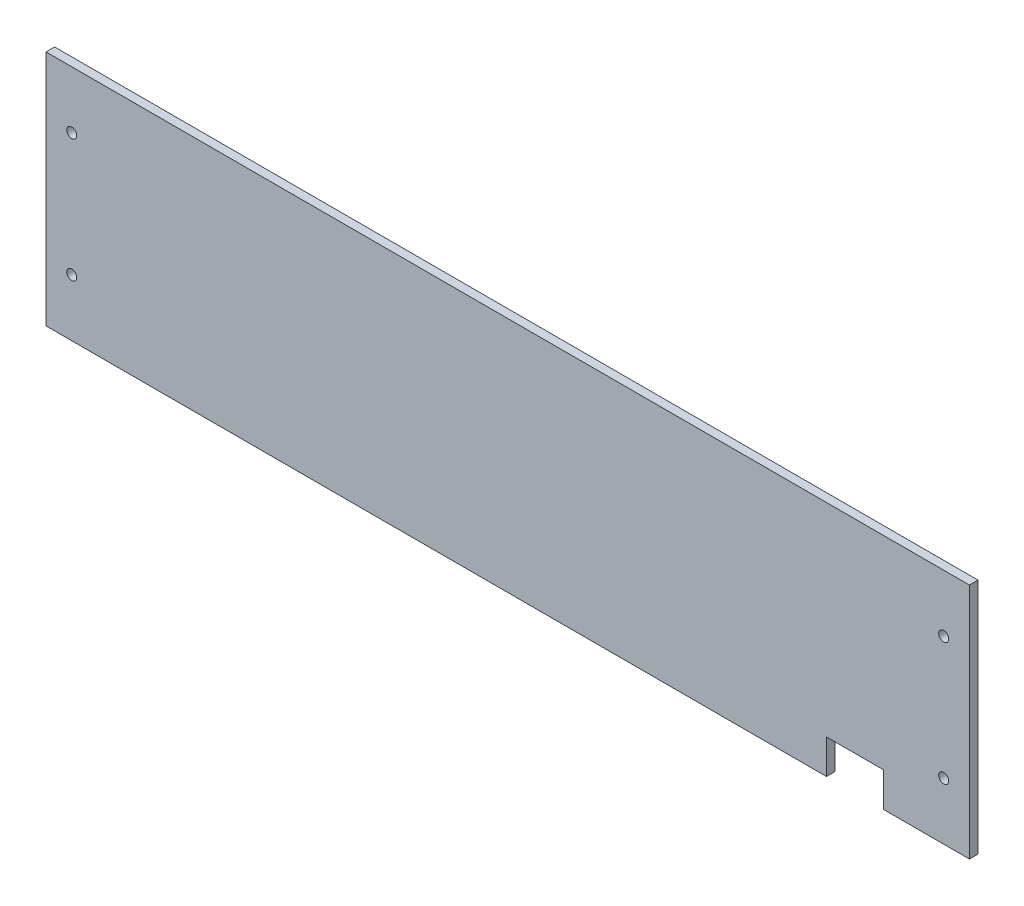
ISO-10303-21;
HEADER;
FILE_DESCRIPTION(('STEP AP214'),'2;1');
FILE_NAME('part.step','',(''),(''),'','','');
FILE_SCHEMA(('AUTOMOTIVE_DESIGN { 1 0 10303 214 1 1 1 1 }'));
ENDSEC;
DATA;
#1=APPLICATION_CONTEXT('core data for automotive mechanical design processes');
#2=APPLICATION_PROTOCOL_DEFINITION('international standard','automotive_design',2000,#1);
#3=PRODUCT_CONTEXT('',#1,'mechanical');
#4=PRODUCT('Part','Part','',(#3));
#5=PRODUCT_RELATED_PRODUCT_CATEGORY('part','',(#4));
#6=PRODUCT_DEFINITION_FORMATION('','',#4);
#7=PRODUCT_DEFINITION_CONTEXT('part definition',#1,'design');
#8=PRODUCT_DEFINITION('design','',#6,#7);
#9=PRODUCT_DEFINITION_SHAPE('','',#8);
#10=(LENGTH_UNIT() NAMED_UNIT(*) SI_UNIT(.MILLI.,.METRE.));
#11=(NAMED_UNIT(*) PLANE_ANGLE_UNIT() SI_UNIT($,.RADIAN.));
#12=(NAMED_UNIT(*) SI_UNIT($,.STERADIAN.) SOLID_ANGLE_UNIT());
#13=UNCERTAINTY_MEASURE_WITH_UNIT(LENGTH_MEASURE(1.E-05),#10,'distance_accuracy_value','');
#14=(GEOMETRIC_REPRESENTATION_CONTEXT(3) GLOBAL_UNCERTAINTY_ASSIGNED_CONTEXT((#13)) GLOBAL_UNIT_ASSIGNED_CONTEXT((#10,
#11,#12)) REPRESENTATION_CONTEXT('',''));
#15=CARTESIAN_POINT('',(0.,0.,0.));
#16=DIRECTION('',(0.,0.,1.));
#17=DIRECTION('',(1.,0.,0.));
#18=AXIS2_PLACEMENT_3D('',#15,#16,#17);
#19=CARTESIAN_POINT('',(-161.5,-41.5,3.));
#20=DIRECTION('',(0.,1.,0.));
#21=DIRECTION('',(0.,0.,1.));
#22=AXIS2_PLACEMENT_3D('',#19,#20,#21);
#23=PLANE('',#22);
#24=DIRECTION('',(1.,0.,0.));
#25=VECTOR('',#24,1.);
#26=CARTESIAN_POINT('',(-161.5,-41.5,3.));
#27=LINE('',#26,#25);
#28=CARTESIAN_POINT('',(131.5,-41.5,3.));
#29=VERTEX_POINT('',#28);
#30=CARTESIAN_POINT('',(161.5,-41.5,3.));
#31=VERTEX_POINT('',#30);
#32=EDGE_CURVE('E63',#29,#31,#27,.T.);
#33=ORIENTED_EDGE('',*,*,#32,.F.);
#34=DIRECTION('',(0.,0.,-1.));
#35=VECTOR('',#34,1.);
#36=CARTESIAN_POINT('',(131.5,-41.5,10.));
#37=LINE('',#36,#35);
#38=CARTESIAN_POINT('',(131.5,-41.5,0.));
#39=VERTEX_POINT('',#38);
#40=EDGE_CURVE('E139',#29,#39,#37,.T.);
#41=ORIENTED_EDGE('',*,*,#40,.T.);
#42=DIRECTION('',(1.,0.,0.));
#43=VECTOR('',#42,1.);
#44=CARTESIAN_POINT('',(-161.5,-41.5,0.));
#45=LINE('',#44,#43);
#46=CARTESIAN_POINT('',(161.5,-41.5,0.));
#47=VERTEX_POINT('',#46);
#48=EDGE_CURVE('E85',#39,#47,#45,.T.);
#49=ORIENTED_EDGE('',*,*,#48,.T.);
#50=DIRECTION('',(0.,0.,-1.));
#51=VECTOR('',#50,1.);
#52=CARTESIAN_POINT('',(161.5,-41.5,3.));
#53=LINE('',#52,#51);
#54=EDGE_CURVE('E158',#31,#47,#53,.T.);
#55=ORIENTED_EDGE('',*,*,#54,.F.);
#56=EDGE_LOOP('',(#33,#41,#49,#55));
#57=FACE_BOUND('',#56,.T.);
#58=ADVANCED_FACE('F39',(#57),#23,.F.);
#59=CARTESIAN_POINT('',(161.5,41.5,3.));
#60=DIRECTION('',(-1.,0.,0.));
#61=DIRECTION('',(0.,0.,1.));
#62=AXIS2_PLACEMENT_3D('',#59,#60,#61);
#63=PLANE('',#62);
#64=DIRECTION('',(0.,1.,0.));
#65=VECTOR('',#64,1.);
#66=CARTESIAN_POINT('',(161.5,41.5,0.));
#67=LINE('',#66,#65);
#68=CARTESIAN_POINT('',(161.5,41.5,0.));
#69=VERTEX_POINT('',#68);
#70=EDGE_CURVE('E148',#47,#69,#67,.T.);
#71=ORIENTED_EDGE('',*,*,#70,.T.);
#72=DIRECTION('',(0.,0.,-1.));
#73=VECTOR('',#72,1.);
#74=CARTESIAN_POINT('',(161.5,41.5,3.));
#75=LINE('',#74,#73);
#76=CARTESIAN_POINT('',(161.5,41.5,3.));
#77=VERTEX_POINT('',#76);
#78=EDGE_CURVE('E11',#77,#69,#75,.T.);
#79=ORIENTED_EDGE('',*,*,#78,.F.);
#80=DIRECTION('',(0.,1.,0.));
#81=VECTOR('',#80,1.);
#82=CARTESIAN_POINT('',(161.5,41.5,3.));
#83=LINE('',#82,#81);
#84=EDGE_CURVE('E149',#31,#77,#83,.T.);
#85=ORIENTED_EDGE('',*,*,#84,.F.);
#86=ORIENTED_EDGE('',*,*,#54,.T.);
#87=EDGE_LOOP('',(#71,#79,#85,#86));
#88=FACE_BOUND('',#87,.T.);
#89=ADVANCED_FACE('F41',(#88),#63,.F.);
#90=CARTESIAN_POINT('',(-161.5,41.5,3.));
#91=DIRECTION('',(0.,-1.,0.));
#92=DIRECTION('',(0.,0.,-1.));
#93=AXIS2_PLACEMENT_3D('',#90,#91,#92);
#94=PLANE('',#93);
#95=DIRECTION('',(-1.,0.,0.));
#96=VECTOR('',#95,1.);
#97=CARTESIAN_POINT('',(-161.5,41.5,0.));
#98=LINE('',#97,#96);
#99=CARTESIAN_POINT('',(-161.5,41.5,0.));
#100=VERTEX_POINT('',#99);
#101=EDGE_CURVE('E161',#69,#100,#98,.T.);
#102=ORIENTED_EDGE('',*,*,#101,.T.);
#103=DIRECTION('',(0.,0.,-1.));
#104=VECTOR('',#103,1.);
#105=CARTESIAN_POINT('',(-161.5,41.5,3.));
#106=LINE('',#105,#104);
#107=CARTESIAN_POINT('',(-161.5,41.5,3.));
#108=VERTEX_POINT('',#107);
#109=EDGE_CURVE('E47',#108,#100,#106,.T.);
#110=ORIENTED_EDGE('',*,*,#109,.F.);
#111=DIRECTION('',(-1.,0.,0.));
#112=VECTOR('',#111,1.);
#113=CARTESIAN_POINT('',(-161.5,41.5,3.));
#114=LINE('',#113,#112);
#115=EDGE_CURVE('E92',#77,#108,#114,.T.);
#116=ORIENTED_EDGE('',*,*,#115,.F.);
#117=ORIENTED_EDGE('',*,*,#78,.T.);
#118=EDGE_LOOP('',(#102,#110,#116,#117));
#119=FACE_BOUND('',#118,.T.);
#120=ADVANCED_FACE('F183',(#119),#94,.F.);
#121=CARTESIAN_POINT('',(-161.5,41.5,3.));
#122=DIRECTION('',(1.,0.,0.));
#123=DIRECTION('',(0.,0.,-1.));
#124=AXIS2_PLACEMENT_3D('',#121,#122,#123);
#125=PLANE('',#124);
#126=DIRECTION('',(0.,-1.,0.));
#127=VECTOR('',#126,1.);
#128=CARTESIAN_POINT('',(-161.5,41.5,0.));
#129=LINE('',#128,#127);
#130=CARTESIAN_POINT('',(-161.5,-41.5,0.));
#131=VERTEX_POINT('',#130);
#132=EDGE_CURVE('E163',#100,#131,#129,.T.);
#133=ORIENTED_EDGE('',*,*,#132,.T.);
#134=DIRECTION('',(0.,0.,-1.));
#135=VECTOR('',#134,1.);
#136=CARTESIAN_POINT('',(-161.5,-41.5,3.));
#137=LINE('',#136,#135);
#138=CARTESIAN_POINT('',(-161.5,-41.5,3.));
#139=VERTEX_POINT('',#138);
#140=EDGE_CURVE('E167',#139,#131,#137,.T.);
#141=ORIENTED_EDGE('',*,*,#140,.F.);
#142=DIRECTION('',(0.,-1.,0.));
#143=VECTOR('',#142,1.);
#144=CARTESIAN_POINT('',(-161.5,41.5,3.));
#145=LINE('',#144,#143);
#146=EDGE_CURVE('E153',#108,#139,#145,.T.);
#147=ORIENTED_EDGE('',*,*,#146,.F.);
#148=ORIENTED_EDGE('',*,*,#109,.T.);
#149=EDGE_LOOP('',(#133,#141,#147,#148));
#150=FACE_BOUND('',#149,.T.);
#151=ADVANCED_FACE('F173',(#150),#125,.F.);
#152=CARTESIAN_POINT('',(111.5,-41.5,0.));
#153=VERTEX_POINT('',#152);
#154=EDGE_CURVE('E151',#131,#153,#45,.T.);
#155=ORIENTED_EDGE('',*,*,#154,.T.);
#156=DIRECTION('',(0.,0.,-1.));
#157=VECTOR('',#156,1.);
#158=CARTESIAN_POINT('',(111.5,-41.5,10.));
#159=LINE('',#158,#157);
#160=CARTESIAN_POINT('',(111.5,-41.5,3.));
#161=VERTEX_POINT('',#160);
#162=EDGE_CURVE('E54',#161,#153,#159,.T.);
#163=ORIENTED_EDGE('',*,*,#162,.F.);
#164=EDGE_CURVE('E155',#139,#161,#27,.T.);
#165=ORIENTED_EDGE('',*,*,#164,.F.);
#166=ORIENTED_EDGE('',*,*,#140,.T.);
#167=EDGE_LOOP('',(#155,#163,#165,#166));
#168=FACE_BOUND('',#167,.T.);
#169=ADVANCED_FACE('F177',(#168),#23,.F.);
#170=CARTESIAN_POINT('',(0.,0.,3.));
#171=DIRECTION('',(0.,0.,1.));
#172=DIRECTION('',(1.,0.,0.));
#173=AXIS2_PLACEMENT_3D('',#170,#171,#172);
#174=PLANE('',#173);
#175=CARTESIAN_POINT('',(152.5,-21.5,3.));
#176=DIRECTION('',(0.,0.,-1.));
#177=DIRECTION('',(-1.,0.,0.));
#178=AXIS2_PLACEMENT_3D('',#175,#176,#177);
#179=CIRCLE('',#178,1.75000000000001);
#180=CARTESIAN_POINT('',(150.75,-21.5,3.));
#181=VERTEX_POINT('',#180);
#182=EDGE_CURVE('E256',#181,#181,#179,.T.);
#183=ORIENTED_EDGE('',*,*,#182,.T.);
#184=EDGE_LOOP('',(#183));
#185=FACE_BOUND('',#184,.T.);
#186=CARTESIAN_POINT('',(-152.5,21.5,3.));
#187=DIRECTION('',(0.,0.,-1.));
#188=DIRECTION('',(-1.,0.,0.));
#189=AXIS2_PLACEMENT_3D('',#186,#187,#188);
#190=CIRCLE('',#189,1.75000000000001);
#191=CARTESIAN_POINT('',(-154.25,21.5,3.));
#192=VERTEX_POINT('',#191);
#193=EDGE_CURVE('E245',#192,#192,#190,.T.);
#194=ORIENTED_EDGE('',*,*,#193,.T.);
#195=EDGE_LOOP('',(#194));
#196=FACE_BOUND('',#195,.T.);
#197=CARTESIAN_POINT('',(152.5,21.5,3.));
#198=DIRECTION('',(0.,0.,-1.));
#199=DIRECTION('',(-1.,0.,0.));
#200=AXIS2_PLACEMENT_3D('',#197,#198,#199);
#201=CIRCLE('',#200,1.75000000000001);
#202=CARTESIAN_POINT('',(150.75,21.5,3.));
#203=VERTEX_POINT('',#202);
#204=EDGE_CURVE('E240',#203,#203,#201,.T.);
#205=ORIENTED_EDGE('',*,*,#204,.T.);
#206=EDGE_LOOP('',(#205));
#207=FACE_BOUND('',#206,.T.);
#208=CARTESIAN_POINT('',(-152.5,-21.5,3.));
#209=DIRECTION('',(0.,0.,-1.));
#210=DIRECTION('',(-1.,0.,0.));
#211=AXIS2_PLACEMENT_3D('',#208,#209,#210);
#212=CIRCLE('',#211,1.75000000000001);
#213=CARTESIAN_POINT('',(-154.25,-21.5,3.));
#214=VERTEX_POINT('',#213);
#215=EDGE_CURVE('E131',#214,#214,#212,.T.);
#216=ORIENTED_EDGE('',*,*,#215,.T.);
#217=EDGE_LOOP('',(#216));
#218=FACE_BOUND('',#217,.T.);
#219=DIRECTION('',(0.,1.,0.));
#220=VECTOR('',#219,1.);
#221=CARTESIAN_POINT('',(131.5,3.041548494546E-13,3.));
#222=LINE('',#221,#220);
#223=CARTESIAN_POINT('',(131.5,-29.5,3.));
#224=VERTEX_POINT('',#223);
#225=EDGE_CURVE('E146',#29,#224,#222,.T.);
#226=ORIENTED_EDGE('',*,*,#225,.F.);
#227=ORIENTED_EDGE('',*,*,#32,.T.);
#228=ORIENTED_EDGE('',*,*,#84,.T.);
#229=ORIENTED_EDGE('',*,*,#115,.T.);
#230=ORIENTED_EDGE('',*,*,#146,.T.);
#231=ORIENTED_EDGE('',*,*,#164,.T.);
#232=DIRECTION('',(0.,-1.,0.));
#233=VECTOR('',#232,1.);
#234=CARTESIAN_POINT('',(111.5,0.,3.));
#235=LINE('',#234,#233);
#236=CARTESIAN_POINT('',(111.5,-29.5,3.));
#237=VERTEX_POINT('',#236);
#238=EDGE_CURVE('E141',#237,#161,#235,.T.);
#239=ORIENTED_EDGE('',*,*,#238,.F.);
#240=DIRECTION('',(-1.,0.,0.));
#241=VECTOR('',#240,1.);
#242=CARTESIAN_POINT('',(0.,-29.5,3.));
#243=LINE('',#242,#241);
#244=EDGE_CURVE('E122',#224,#237,#243,.T.);
#245=ORIENTED_EDGE('',*,*,#244,.F.);
#246=EDGE_LOOP('',(#226,#227,#228,#229,#230,#231,#239,#245));
#247=FACE_BOUND('',#246,.T.);
#248=ADVANCED_FACE('F179',(#185,#196,#207,#218,#247),#174,.T.);
#249=CARTESIAN_POINT('',(0.,0.,0.));
#250=DIRECTION('',(0.,0.,1.));
#251=DIRECTION('',(1.,0.,0.));
#252=AXIS2_PLACEMENT_3D('',#249,#250,#251);
#253=PLANE('',#252);
#254=CARTESIAN_POINT('',(152.5,-21.5,0.));
#255=DIRECTION('',(0.,0.,-1.));
#256=DIRECTION('',(-1.,0.,0.));
#257=AXIS2_PLACEMENT_3D('',#254,#255,#256);
#258=CIRCLE('',#257,1.75000000000001);
#259=CARTESIAN_POINT('',(150.75,-21.5,0.));
#260=VERTEX_POINT('',#259);
#261=EDGE_CURVE('E252',#260,#260,#258,.T.);
#262=ORIENTED_EDGE('',*,*,#261,.F.);
#263=EDGE_LOOP('',(#262));
#264=FACE_BOUND('',#263,.T.);
#265=CARTESIAN_POINT('',(-152.5,21.5,0.));
#266=DIRECTION('',(0.,0.,-1.));
#267=DIRECTION('',(-1.,0.,0.));
#268=AXIS2_PLACEMENT_3D('',#265,#266,#267);
#269=CIRCLE('',#268,1.75000000000001);
#270=CARTESIAN_POINT('',(-154.25,21.5,0.));
#271=VERTEX_POINT('',#270);
#272=EDGE_CURVE('E248',#271,#271,#269,.T.);
#273=ORIENTED_EDGE('',*,*,#272,.F.);
#274=EDGE_LOOP('',(#273));
#275=FACE_BOUND('',#274,.T.);
#276=CARTESIAN_POINT('',(152.5,21.5,0.));
#277=DIRECTION('',(0.,0.,-1.));
#278=DIRECTION('',(-1.,0.,0.));
#279=AXIS2_PLACEMENT_3D('',#276,#277,#278);
#280=CIRCLE('',#279,1.75000000000001);
#281=CARTESIAN_POINT('',(150.75,21.5,0.));
#282=VERTEX_POINT('',#281);
#283=EDGE_CURVE('E243',#282,#282,#280,.T.);
#284=ORIENTED_EDGE('',*,*,#283,.F.);
#285=EDGE_LOOP('',(#284));
#286=FACE_BOUND('',#285,.T.);
#287=CARTESIAN_POINT('',(-152.5,-21.5,0.));
#288=DIRECTION('',(0.,0.,-1.));
#289=DIRECTION('',(-1.,0.,0.));
#290=AXIS2_PLACEMENT_3D('',#287,#288,#289);
#291=CIRCLE('',#290,1.75000000000001);
#292=CARTESIAN_POINT('',(-154.25,-21.5,0.));
#293=VERTEX_POINT('',#292);
#294=EDGE_CURVE('E255',#293,#293,#291,.T.);
#295=ORIENTED_EDGE('',*,*,#294,.F.);
#296=EDGE_LOOP('',(#295));
#297=FACE_BOUND('',#296,.T.);
#298=ORIENTED_EDGE('',*,*,#48,.F.);
#299=DIRECTION('',(0.,-1.,0.));
#300=VECTOR('',#299,1.);
#301=CARTESIAN_POINT('',(131.5,-41.5,0.));
#302=LINE('',#301,#300);
#303=CARTESIAN_POINT('',(131.5,-29.5,0.));
#304=VERTEX_POINT('',#303);
#305=EDGE_CURVE('E134',#304,#39,#302,.T.);
#306=ORIENTED_EDGE('',*,*,#305,.F.);
#307=DIRECTION('',(1.,0.,0.));
#308=VECTOR('',#307,1.);
#309=CARTESIAN_POINT('',(131.5,-29.5,0.));
#310=LINE('',#309,#308);
#311=CARTESIAN_POINT('',(111.5,-29.5,0.));
#312=VERTEX_POINT('',#311);
#313=EDGE_CURVE('E119',#312,#304,#310,.T.);
#314=ORIENTED_EDGE('',*,*,#313,.F.);
#315=DIRECTION('',(0.,1.,0.));
#316=VECTOR('',#315,1.);
#317=CARTESIAN_POINT('',(111.5,-29.5,0.));
#318=LINE('',#317,#316);
#319=EDGE_CURVE('E126',#153,#312,#318,.T.);
#320=ORIENTED_EDGE('',*,*,#319,.F.);
#321=ORIENTED_EDGE('',*,*,#154,.F.);
#322=ORIENTED_EDGE('',*,*,#132,.F.);
#323=ORIENTED_EDGE('',*,*,#101,.F.);
#324=ORIENTED_EDGE('',*,*,#70,.F.);
#325=EDGE_LOOP('',(#298,#306,#314,#320,#321,#322,#323,#324));
#326=FACE_BOUND('',#325,.T.);
#327=ADVANCED_FACE('F133',(#264,#275,#286,#297,#326),#253,.F.);
#328=CARTESIAN_POINT('',(131.5,-41.5,10.));
#329=DIRECTION('',(1.,0.,0.));
#330=DIRECTION('',(0.,1.,0.));
#331=AXIS2_PLACEMENT_3D('',#328,#329,#330);
#332=PLANE('',#331);
#333=ORIENTED_EDGE('',*,*,#225,.T.);
#334=DIRECTION('',(0.,0.,-1.));
#335=VECTOR('',#334,1.);
#336=CARTESIAN_POINT('',(131.5,-29.5,10.));
#337=LINE('',#336,#335);
#338=EDGE_CURVE('E124',#224,#304,#337,.T.);
#339=ORIENTED_EDGE('',*,*,#338,.T.);
#340=ORIENTED_EDGE('',*,*,#305,.T.);
#341=ORIENTED_EDGE('',*,*,#40,.F.);
#342=EDGE_LOOP('',(#333,#339,#340,#341));
#343=FACE_BOUND('',#342,.T.);
#344=ADVANCED_FACE('F208',(#343),#332,.F.);
#345=CARTESIAN_POINT('',(131.5,-29.5,10.));
#346=DIRECTION('',(0.,1.,0.));
#347=DIRECTION('',(0.,0.,1.));
#348=AXIS2_PLACEMENT_3D('',#345,#346,#347);
#349=PLANE('',#348);
#350=ORIENTED_EDGE('',*,*,#244,.T.);
#351=DIRECTION('',(0.,0.,-1.));
#352=VECTOR('',#351,1.);
#353=CARTESIAN_POINT('',(111.5,-29.5,10.));
#354=LINE('',#353,#352);
#355=EDGE_CURVE('E115',#237,#312,#354,.T.);
#356=ORIENTED_EDGE('',*,*,#355,.T.);
#357=ORIENTED_EDGE('',*,*,#313,.T.);
#358=ORIENTED_EDGE('',*,*,#338,.F.);
#359=EDGE_LOOP('',(#350,#356,#357,#358));
#360=FACE_BOUND('',#359,.T.);
#361=ADVANCED_FACE('F116',(#360),#349,.F.);
#362=CARTESIAN_POINT('',(111.5,-29.5,10.));
#363=DIRECTION('',(-1.,0.,0.));
#364=DIRECTION('',(0.,0.,1.));
#365=AXIS2_PLACEMENT_3D('',#362,#363,#364);
#366=PLANE('',#365);
#367=ORIENTED_EDGE('',*,*,#238,.T.);
#368=ORIENTED_EDGE('',*,*,#162,.T.);
#369=ORIENTED_EDGE('',*,*,#319,.T.);
#370=ORIENTED_EDGE('',*,*,#355,.F.);
#371=EDGE_LOOP('',(#367,#368,#369,#370));
#372=FACE_BOUND('',#371,.T.);
#373=ADVANCED_FACE('F127',(#372),#366,.F.);
#374=CARTESIAN_POINT('',(-152.5,-21.5,3.));
#375=DIRECTION('',(0.,0.,-1.));
#376=DIRECTION('',(-1.,0.,0.));
#377=AXIS2_PLACEMENT_3D('',#374,#375,#376);
#378=CYLINDRICAL_SURFACE('',#377,1.75000000000001);
#379=ORIENTED_EDGE('',*,*,#215,.F.);
#380=EDGE_LOOP('',(#379));
#381=FACE_BOUND('',#380,.T.);
#382=ORIENTED_EDGE('',*,*,#294,.T.);
#383=EDGE_LOOP('',(#382));
#384=FACE_BOUND('',#383,.T.);
#385=ADVANCED_FACE('F215',(#381,#384),#378,.F.);
#386=CARTESIAN_POINT('',(152.5,21.5,3.));
#387=DIRECTION('',(0.,0.,-1.));
#388=DIRECTION('',(-1.,0.,0.));
#389=AXIS2_PLACEMENT_3D('',#386,#387,#388);
#390=CYLINDRICAL_SURFACE('',#389,1.75000000000001);
#391=ORIENTED_EDGE('',*,*,#204,.F.);
#392=EDGE_LOOP('',(#391));
#393=FACE_BOUND('',#392,.T.);
#394=ORIENTED_EDGE('',*,*,#283,.T.);
#395=EDGE_LOOP('',(#394));
#396=FACE_BOUND('',#395,.T.);
#397=ADVANCED_FACE('F223',(#393,#396),#390,.F.);
#398=CARTESIAN_POINT('',(-152.5,21.5,3.));
#399=DIRECTION('',(0.,0.,-1.));
#400=DIRECTION('',(-1.,0.,0.));
#401=AXIS2_PLACEMENT_3D('',#398,#399,#400);
#402=CYLINDRICAL_SURFACE('',#401,1.75000000000001);
#403=ORIENTED_EDGE('',*,*,#193,.F.);
#404=EDGE_LOOP('',(#403));
#405=FACE_BOUND('',#404,.T.);
#406=ORIENTED_EDGE('',*,*,#272,.T.);
#407=EDGE_LOOP('',(#406));
#408=FACE_BOUND('',#407,.T.);
#409=ADVANCED_FACE('F225',(#405,#408),#402,.F.);
#410=CARTESIAN_POINT('',(152.5,-21.5,3.));
#411=DIRECTION('',(0.,0.,-1.));
#412=DIRECTION('',(-1.,0.,0.));
#413=AXIS2_PLACEMENT_3D('',#410,#411,#412);
#414=CYLINDRICAL_SURFACE('',#413,1.75000000000001);
#415=ORIENTED_EDGE('',*,*,#182,.F.);
#416=EDGE_LOOP('',(#415));
#417=FACE_BOUND('',#416,.T.);
#418=ORIENTED_EDGE('',*,*,#261,.T.);
#419=EDGE_LOOP('',(#418));
#420=FACE_BOUND('',#419,.T.);
#421=ADVANCED_FACE('F228',(#417,#420),#414,.F.);
#422=CLOSED_SHELL('',(#58,#89,#120,#151,#169,#248,#327,#344,#361,#373,#385,#397,#409,#421));
#423=MANIFOLD_SOLID_BREP('B2',#422);
#424=ADVANCED_BREP_SHAPE_REPRESENTATION('',(#18,#423),#14);
#425=SHAPE_DEFINITION_REPRESENTATION(#9,#424);
ENDSEC;
END-ISO-10303-21;
